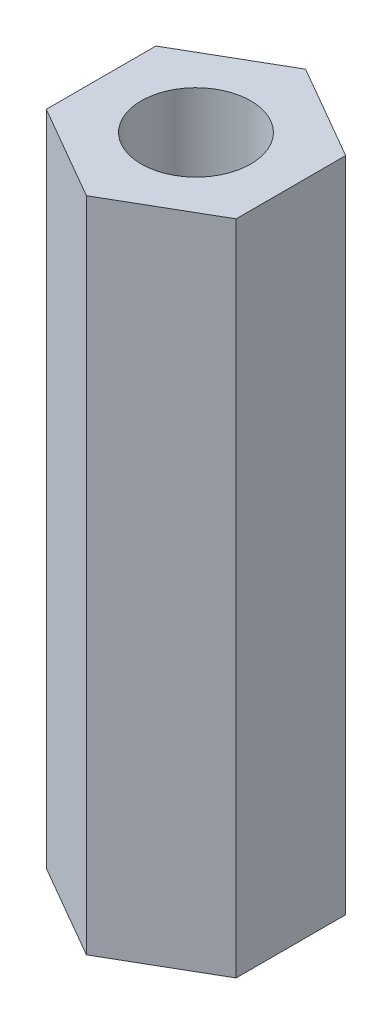
ISO-10303-21;
HEADER;
FILE_DESCRIPTION(('STEP AP214'),'2;1');
FILE_NAME('part.step','',(''),(''),'','','');
FILE_SCHEMA(('AUTOMOTIVE_DESIGN { 1 0 10303 214 1 1 1 1 }'));
ENDSEC;
DATA;
#1=APPLICATION_CONTEXT('core data for automotive mechanical design processes');
#2=APPLICATION_PROTOCOL_DEFINITION('international standard','automotive_design',2000,#1);
#3=PRODUCT_CONTEXT('',#1,'mechanical');
#4=PRODUCT('Part','Part','',(#3));
#5=PRODUCT_RELATED_PRODUCT_CATEGORY('part','',(#4));
#6=PRODUCT_DEFINITION_FORMATION('','',#4);
#7=PRODUCT_DEFINITION_CONTEXT('part definition',#1,'design');
#8=PRODUCT_DEFINITION('design','',#6,#7);
#9=PRODUCT_DEFINITION_SHAPE('','',#8);
#10=(LENGTH_UNIT() NAMED_UNIT(*) SI_UNIT(.MILLI.,.METRE.));
#11=(NAMED_UNIT(*) PLANE_ANGLE_UNIT() SI_UNIT($,.RADIAN.));
#12=(NAMED_UNIT(*) SI_UNIT($,.STERADIAN.) SOLID_ANGLE_UNIT());
#13=UNCERTAINTY_MEASURE_WITH_UNIT(LENGTH_MEASURE(1.E-05),#10,'distance_accuracy_value','');
#14=(GEOMETRIC_REPRESENTATION_CONTEXT(3) GLOBAL_UNCERTAINTY_ASSIGNED_CONTEXT((#13)) GLOBAL_UNIT_ASSIGNED_CONTEXT((#10,
#11,#12)) REPRESENTATION_CONTEXT('',''));
#15=CARTESIAN_POINT('',(0.,0.,0.));
#16=DIRECTION('',(0.,0.,1.));
#17=DIRECTION('',(1.,0.,0.));
#18=AXIS2_PLACEMENT_3D('',#15,#16,#17);
#19=CARTESIAN_POINT('',(0.,30.,-5.));
#20=DIRECTION('',(0.,1.,0.));
#21=DIRECTION('',(0.,0.,1.));
#22=AXIS2_PLACEMENT_3D('',#19,#20,#21);
#23=PLANE('',#22);
#24=DIRECTION('',(-0.866025403784439,0.,-0.5));
#25=VECTOR('',#24,1.);
#26=CARTESIAN_POINT('',(4.33012701892219,30.,-2.5));
#27=LINE('',#26,#25);
#28=CARTESIAN_POINT('',(4.33012701892219,30.,-2.5));
#29=VERTEX_POINT('',#28);
#30=CARTESIAN_POINT('',(0.,30.,-5.));
#31=VERTEX_POINT('',#30);
#32=EDGE_CURVE('E127',#29,#31,#27,.T.);
#33=ORIENTED_EDGE('',*,*,#32,.T.);
#34=DIRECTION('',(-0.866025403784439,0.,0.5));
#35=VECTOR('',#34,1.);
#36=CARTESIAN_POINT('',(0.,30.,-5.));
#37=LINE('',#36,#35);
#38=CARTESIAN_POINT('',(-4.33012701892219,30.,-2.5));
#39=VERTEX_POINT('',#38);
#40=EDGE_CURVE('E85',#31,#39,#37,.T.);
#41=ORIENTED_EDGE('',*,*,#40,.T.);
#42=DIRECTION('',(0.,0.,1.));
#43=VECTOR('',#42,1.);
#44=CARTESIAN_POINT('',(-4.33012701892219,30.,-2.5));
#45=LINE('',#44,#43);
#46=CARTESIAN_POINT('',(-4.33012701892219,30.,2.5));
#47=VERTEX_POINT('',#46);
#48=EDGE_CURVE('E98',#39,#47,#45,.T.);
#49=ORIENTED_EDGE('',*,*,#48,.T.);
#50=DIRECTION('',(0.866025403784439,0.,0.5));
#51=VECTOR('',#50,1.);
#52=CARTESIAN_POINT('',(-4.33012701892219,30.,2.5));
#53=LINE('',#52,#51);
#54=CARTESIAN_POINT('',(0.,30.,5.));
#55=VERTEX_POINT('',#54);
#56=EDGE_CURVE('E92',#47,#55,#53,.T.);
#57=ORIENTED_EDGE('',*,*,#56,.T.);
#58=DIRECTION('',(0.866025403784439,0.,-0.5));
#59=VECTOR('',#58,1.);
#60=CARTESIAN_POINT('',(0.,30.,5.));
#61=LINE('',#60,#59);
#62=CARTESIAN_POINT('',(4.33012701892219,30.,2.5));
#63=VERTEX_POINT('',#62);
#64=EDGE_CURVE('E96',#55,#63,#61,.T.);
#65=ORIENTED_EDGE('',*,*,#64,.T.);
#66=DIRECTION('',(0.,0.,-1.));
#67=VECTOR('',#66,1.);
#68=CARTESIAN_POINT('',(4.33012701892219,30.,2.5));
#69=LINE('',#68,#67);
#70=EDGE_CURVE('E48',#63,#29,#69,.T.);
#71=ORIENTED_EDGE('',*,*,#70,.T.);
#72=EDGE_LOOP('',(#33,#41,#49,#57,#65,#71));
#73=FACE_BOUND('',#72,.T.);
#74=CARTESIAN_POINT('',(0.,30.,0.));
#75=DIRECTION('',(0.,1.,0.));
#76=DIRECTION('',(0.,0.,1.));
#77=AXIS2_PLACEMENT_3D('',#74,#75,#76);
#78=CIRCLE('',#77,2.5);
#79=CARTESIAN_POINT('',(0.,30.,2.5));
#80=VERTEX_POINT('',#79);
#81=EDGE_CURVE('E120',#80,#80,#78,.T.);
#82=ORIENTED_EDGE('',*,*,#81,.F.);
#83=EDGE_LOOP('',(#82));
#84=FACE_BOUND('',#83,.T.);
#85=ADVANCED_FACE('F31',(#73,#84),#23,.T.);
#86=CARTESIAN_POINT('',(0.,0.,-5.));
#87=DIRECTION('',(0.,1.,0.));
#88=DIRECTION('',(0.,0.,1.));
#89=AXIS2_PLACEMENT_3D('',#86,#87,#88);
#90=PLANE('',#89);
#91=DIRECTION('',(-0.866025403784439,0.,-0.5));
#92=VECTOR('',#91,1.);
#93=CARTESIAN_POINT('',(4.33012701892219,0.,-2.5));
#94=LINE('',#93,#92);
#95=CARTESIAN_POINT('',(4.33012701892219,0.,-2.5));
#96=VERTEX_POINT('',#95);
#97=CARTESIAN_POINT('',(0.,0.,-5.));
#98=VERTEX_POINT('',#97);
#99=EDGE_CURVE('E116',#96,#98,#94,.T.);
#100=ORIENTED_EDGE('',*,*,#99,.F.);
#101=DIRECTION('',(0.,0.,-1.));
#102=VECTOR('',#101,1.);
#103=CARTESIAN_POINT('',(4.33012701892219,0.,2.5));
#104=LINE('',#103,#102);
#105=CARTESIAN_POINT('',(4.33012701892219,0.,2.5));
#106=VERTEX_POINT('',#105);
#107=EDGE_CURVE('E77',#106,#96,#104,.T.);
#108=ORIENTED_EDGE('',*,*,#107,.F.);
#109=DIRECTION('',(0.866025403784439,0.,-0.5));
#110=VECTOR('',#109,1.);
#111=CARTESIAN_POINT('',(0.,0.,5.));
#112=LINE('',#111,#110);
#113=CARTESIAN_POINT('',(0.,0.,5.));
#114=VERTEX_POINT('',#113);
#115=EDGE_CURVE('E71',#114,#106,#112,.T.);
#116=ORIENTED_EDGE('',*,*,#115,.F.);
#117=DIRECTION('',(0.866025403784439,0.,0.5));
#118=VECTOR('',#117,1.);
#119=CARTESIAN_POINT('',(-4.33012701892219,0.,2.5));
#120=LINE('',#119,#118);
#121=CARTESIAN_POINT('',(-4.33012701892219,0.,2.5));
#122=VERTEX_POINT('',#121);
#123=EDGE_CURVE('E106',#122,#114,#120,.T.);
#124=ORIENTED_EDGE('',*,*,#123,.F.);
#125=DIRECTION('',(0.,0.,1.));
#126=VECTOR('',#125,1.);
#127=CARTESIAN_POINT('',(-4.33012701892219,0.,-2.5));
#128=LINE('',#127,#126);
#129=CARTESIAN_POINT('',(-4.33012701892219,0.,-2.5));
#130=VERTEX_POINT('',#129);
#131=EDGE_CURVE('E122',#130,#122,#128,.T.);
#132=ORIENTED_EDGE('',*,*,#131,.F.);
#133=DIRECTION('',(-0.866025403784439,0.,0.5));
#134=VECTOR('',#133,1.);
#135=CARTESIAN_POINT('',(0.,0.,-5.));
#136=LINE('',#135,#134);
#137=EDGE_CURVE('E119',#98,#130,#136,.T.);
#138=ORIENTED_EDGE('',*,*,#137,.F.);
#139=EDGE_LOOP('',(#100,#108,#116,#124,#132,#138));
#140=FACE_BOUND('',#139,.T.);
#141=CARTESIAN_POINT('',(0.,0.,0.));
#142=DIRECTION('',(0.,1.,0.));
#143=DIRECTION('',(0.,0.,1.));
#144=AXIS2_PLACEMENT_3D('',#141,#142,#143);
#145=CIRCLE('',#144,2.5);
#146=CARTESIAN_POINT('',(0.,0.,2.5));
#147=VERTEX_POINT('',#146);
#148=EDGE_CURVE('E220',#147,#147,#145,.T.);
#149=ORIENTED_EDGE('',*,*,#148,.T.);
#150=EDGE_LOOP('',(#149));
#151=FACE_BOUND('',#150,.T.);
#152=ADVANCED_FACE('F136',(#140,#151),#90,.F.);
#153=CARTESIAN_POINT('',(4.33012701892219,30.,-2.5));
#154=DIRECTION('',(-0.5,0.,0.866025403784439));
#155=DIRECTION('',(0.866025403784439,0.,0.5));
#156=AXIS2_PLACEMENT_3D('',#153,#154,#155);
#157=PLANE('',#156);
#158=ORIENTED_EDGE('',*,*,#99,.T.);
#159=DIRECTION('',(0.,-1.,0.));
#160=VECTOR('',#159,1.);
#161=CARTESIAN_POINT('',(0.,30.,-5.));
#162=LINE('',#161,#160);
#163=EDGE_CURVE('E11',#31,#98,#162,.T.);
#164=ORIENTED_EDGE('',*,*,#163,.F.);
#165=ORIENTED_EDGE('',*,*,#32,.F.);
#166=DIRECTION('',(0.,-1.,0.));
#167=VECTOR('',#166,1.);
#168=CARTESIAN_POINT('',(4.33012701892219,30.,-2.5));
#169=LINE('',#168,#167);
#170=EDGE_CURVE('E112',#29,#96,#169,.T.);
#171=ORIENTED_EDGE('',*,*,#170,.T.);
#172=EDGE_LOOP('',(#158,#164,#165,#171));
#173=FACE_BOUND('',#172,.T.);
#174=ADVANCED_FACE('F33',(#173),#157,.F.);
#175=CARTESIAN_POINT('',(0.,30.,-5.));
#176=DIRECTION('',(0.5,0.,0.866025403784439));
#177=DIRECTION('',(0.866025403784439,0.,-0.5));
#178=AXIS2_PLACEMENT_3D('',#175,#176,#177);
#179=PLANE('',#178);
#180=ORIENTED_EDGE('',*,*,#137,.T.);
#181=DIRECTION('',(0.,-1.,0.));
#182=VECTOR('',#181,1.);
#183=CARTESIAN_POINT('',(-4.33012701892219,30.,-2.5));
#184=LINE('',#183,#182);
#185=EDGE_CURVE('E40',#39,#130,#184,.T.);
#186=ORIENTED_EDGE('',*,*,#185,.F.);
#187=ORIENTED_EDGE('',*,*,#40,.F.);
#188=ORIENTED_EDGE('',*,*,#163,.T.);
#189=EDGE_LOOP('',(#180,#186,#187,#188));
#190=FACE_BOUND('',#189,.T.);
#191=ADVANCED_FACE('F161',(#190),#179,.F.);
#192=CARTESIAN_POINT('',(-4.33012701892219,30.,-2.5));
#193=DIRECTION('',(1.,0.,0.));
#194=DIRECTION('',(0.,0.,-1.));
#195=AXIS2_PLACEMENT_3D('',#192,#193,#194);
#196=PLANE('',#195);
#197=ORIENTED_EDGE('',*,*,#131,.T.);
#198=DIRECTION('',(0.,-1.,0.));
#199=VECTOR('',#198,1.);
#200=CARTESIAN_POINT('',(-4.33012701892219,30.,2.5));
#201=LINE('',#200,#199);
#202=EDGE_CURVE('E107',#47,#122,#201,.T.);
#203=ORIENTED_EDGE('',*,*,#202,.F.);
#204=ORIENTED_EDGE('',*,*,#48,.F.);
#205=ORIENTED_EDGE('',*,*,#185,.T.);
#206=EDGE_LOOP('',(#197,#203,#204,#205));
#207=FACE_BOUND('',#206,.T.);
#208=ADVANCED_FACE('F133',(#207),#196,.F.);
#209=CARTESIAN_POINT('',(-4.33012701892219,30.,2.5));
#210=DIRECTION('',(0.5,0.,-0.866025403784439));
#211=DIRECTION('',(-0.866025403784439,0.,-0.5));
#212=AXIS2_PLACEMENT_3D('',#209,#210,#211);
#213=PLANE('',#212);
#214=ORIENTED_EDGE('',*,*,#123,.T.);
#215=DIRECTION('',(0.,-1.,0.));
#216=VECTOR('',#215,1.);
#217=CARTESIAN_POINT('',(0.,30.,5.));
#218=LINE('',#217,#216);
#219=EDGE_CURVE('E103',#55,#114,#218,.T.);
#220=ORIENTED_EDGE('',*,*,#219,.F.);
#221=ORIENTED_EDGE('',*,*,#56,.F.);
#222=ORIENTED_EDGE('',*,*,#202,.T.);
#223=EDGE_LOOP('',(#214,#220,#221,#222));
#224=FACE_BOUND('',#223,.T.);
#225=ADVANCED_FACE('F104',(#224),#213,.F.);
#226=CARTESIAN_POINT('',(0.,30.,5.));
#227=DIRECTION('',(-0.5,0.,-0.866025403784439));
#228=DIRECTION('',(-0.866025403784439,0.,0.5));
#229=AXIS2_PLACEMENT_3D('',#226,#227,#228);
#230=PLANE('',#229);
#231=ORIENTED_EDGE('',*,*,#115,.T.);
#232=DIRECTION('',(0.,-1.,0.));
#233=VECTOR('',#232,1.);
#234=CARTESIAN_POINT('',(4.33012701892219,30.,2.5));
#235=LINE('',#234,#233);
#236=EDGE_CURVE('E108',#63,#106,#235,.T.);
#237=ORIENTED_EDGE('',*,*,#236,.F.);
#238=ORIENTED_EDGE('',*,*,#64,.F.);
#239=ORIENTED_EDGE('',*,*,#219,.T.);
#240=EDGE_LOOP('',(#231,#237,#238,#239));
#241=FACE_BOUND('',#240,.T.);
#242=ADVANCED_FACE('F110',(#241),#230,.F.);
#243=CARTESIAN_POINT('',(4.33012701892219,30.,2.5));
#244=DIRECTION('',(-1.,0.,0.));
#245=DIRECTION('',(0.,0.,1.));
#246=AXIS2_PLACEMENT_3D('',#243,#244,#245);
#247=PLANE('',#246);
#248=ORIENTED_EDGE('',*,*,#107,.T.);
#249=ORIENTED_EDGE('',*,*,#170,.F.);
#250=ORIENTED_EDGE('',*,*,#70,.F.);
#251=ORIENTED_EDGE('',*,*,#236,.T.);
#252=EDGE_LOOP('',(#248,#249,#250,#251));
#253=FACE_BOUND('',#252,.T.);
#254=ADVANCED_FACE('F141',(#253),#247,.F.);
#255=CARTESIAN_POINT('',(0.,30.,0.));
#256=DIRECTION('',(0.,-1.,0.));
#257=DIRECTION('',(0.,0.,-1.));
#258=AXIS2_PLACEMENT_3D('',#255,#256,#257);
#259=CYLINDRICAL_SURFACE('',#258,2.5);
#260=ORIENTED_EDGE('',*,*,#81,.T.);
#261=EDGE_LOOP('',(#260));
#262=FACE_BOUND('',#261,.T.);
#263=ORIENTED_EDGE('',*,*,#148,.F.);
#264=EDGE_LOOP('',(#263));
#265=FACE_BOUND('',#264,.T.);
#266=ADVANCED_FACE('F143',(#262,#265),#259,.F.);
#267=CLOSED_SHELL('',(#85,#152,#174,#191,#208,#225,#242,#254,#266));
#268=MANIFOLD_SOLID_BREP('B2',#267);
#269=ADVANCED_BREP_SHAPE_REPRESENTATION('',(#18,#268),#14);
#270=SHAPE_DEFINITION_REPRESENTATION(#9,#269);
ENDSEC;
END-ISO-10303-21;
